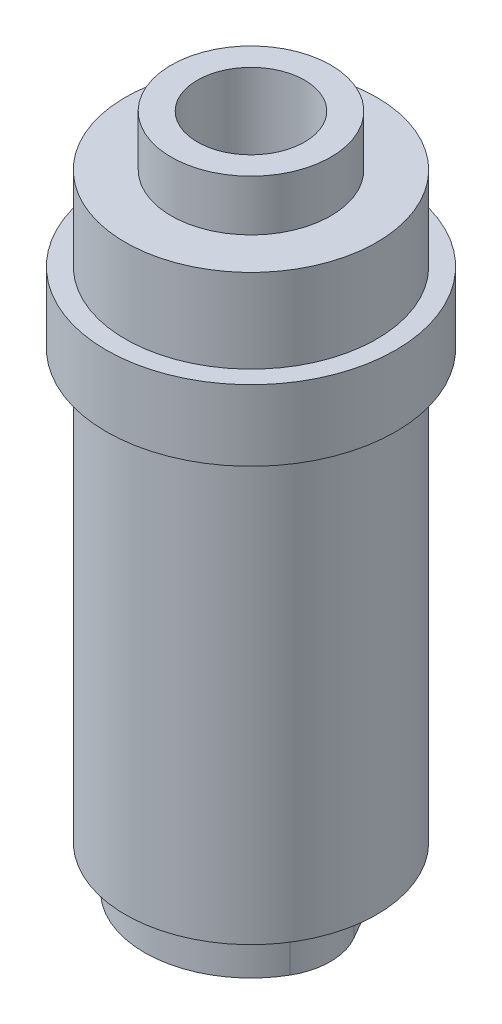
ISO-10303-21;
HEADER;
FILE_DESCRIPTION(('STEP AP214'),'2;1');
FILE_NAME('part.step','',(''),(''),'','','');
FILE_SCHEMA(('AUTOMOTIVE_DESIGN { 1 0 10303 214 1 1 1 1 }'));
ENDSEC;
DATA;
#1=APPLICATION_CONTEXT('core data for automotive mechanical design processes');
#2=APPLICATION_PROTOCOL_DEFINITION('international standard','automotive_design',2000,#1);
#3=PRODUCT_CONTEXT('',#1,'mechanical');
#4=PRODUCT('Part','Part','',(#3));
#5=PRODUCT_RELATED_PRODUCT_CATEGORY('part','',(#4));
#6=PRODUCT_DEFINITION_FORMATION('','',#4);
#7=PRODUCT_DEFINITION_CONTEXT('part definition',#1,'design');
#8=PRODUCT_DEFINITION('design','',#6,#7);
#9=PRODUCT_DEFINITION_SHAPE('','',#8);
#10=(LENGTH_UNIT() NAMED_UNIT(*) SI_UNIT(.MILLI.,.METRE.));
#11=(NAMED_UNIT(*) PLANE_ANGLE_UNIT() SI_UNIT($,.RADIAN.));
#12=(NAMED_UNIT(*) SI_UNIT($,.STERADIAN.) SOLID_ANGLE_UNIT());
#13=UNCERTAINTY_MEASURE_WITH_UNIT(LENGTH_MEASURE(1.E-05),#10,'distance_accuracy_value','');
#14=(GEOMETRIC_REPRESENTATION_CONTEXT(3) GLOBAL_UNCERTAINTY_ASSIGNED_CONTEXT((#13)) GLOBAL_UNIT_ASSIGNED_CONTEXT((#10,
#11,#12)) REPRESENTATION_CONTEXT('',''));
#15=CARTESIAN_POINT('',(0.,0.,0.));
#16=DIRECTION('',(0.,0.,1.));
#17=DIRECTION('',(1.,0.,0.));
#18=AXIS2_PLACEMENT_3D('',#15,#16,#17);
#19=CARTESIAN_POINT('',(0.,19.05,0.));
#20=DIRECTION('',(0.,-1.,0.));
#21=DIRECTION('',(0.,0.,-1.));
#22=AXIS2_PLACEMENT_3D('',#19,#20,#21);
#23=CYLINDRICAL_SURFACE('',#22,4.7625);
#24=CARTESIAN_POINT('',(0.,37.285900282,0.));
#25=DIRECTION('',(0.,-1.,0.));
#26=DIRECTION('',(0.,0.,-1.));
#27=AXIS2_PLACEMENT_3D('',#24,#25,#26);
#28=CIRCLE('',#27,4.7625);
#29=CARTESIAN_POINT('',(0.,37.285900282,-4.7625));
#30=VERTEX_POINT('',#29);
#31=EDGE_CURVE('E97',#30,#30,#28,.T.);
#32=ORIENTED_EDGE('',*,*,#31,.F.);
#33=EDGE_LOOP('',(#32));
#34=FACE_BOUND('',#33,.T.);
#35=CARTESIAN_POINT('',(0.,40.321700408,0.));
#36=DIRECTION('',(0.,-1.,0.));
#37=DIRECTION('',(0.,0.,-1.));
#38=AXIS2_PLACEMENT_3D('',#35,#36,#37);
#39=CIRCLE('',#38,4.7625);
#40=CARTESIAN_POINT('',(0.,40.321700408,-4.7625));
#41=VERTEX_POINT('',#40);
#42=EDGE_CURVE('E11',#41,#41,#39,.T.);
#43=ORIENTED_EDGE('',*,*,#42,.T.);
#44=EDGE_LOOP('',(#43));
#45=FACE_BOUND('',#44,.T.);
#46=ADVANCED_FACE('F16',(#34,#45),#23,.T.);
#47=CARTESIAN_POINT('',(-4.7625,40.321700408,0.));
#48=DIRECTION('',(0.,-1.,0.));
#49=DIRECTION('',(0.,0.,-1.));
#50=AXIS2_PLACEMENT_3D('',#47,#48,#49);
#51=PLANE('',#50);
#52=ORIENTED_EDGE('',*,*,#42,.F.);
#53=EDGE_LOOP('',(#52));
#54=FACE_BOUND('',#53,.T.);
#55=CARTESIAN_POINT('',(0.,40.321700408,0.));
#56=DIRECTION('',(0.,-1.,0.));
#57=DIRECTION('',(0.,0.,-1.));
#58=AXIS2_PLACEMENT_3D('',#55,#56,#57);
#59=CIRCLE('',#58,3.2004);
#60=CARTESIAN_POINT('',(0.,40.321700408,-3.2004));
#61=VERTEX_POINT('',#60);
#62=EDGE_CURVE('E23',#61,#61,#59,.T.);
#63=ORIENTED_EDGE('',*,*,#62,.T.);
#64=EDGE_LOOP('',(#63));
#65=FACE_BOUND('',#64,.T.);
#66=ADVANCED_FACE('F150',(#54,#65),#51,.F.);
#67=CARTESIAN_POINT('',(0.,19.05,0.));
#68=DIRECTION('',(0.,-1.,0.));
#69=DIRECTION('',(0.,0.,-1.));
#70=AXIS2_PLACEMENT_3D('',#67,#68,#69);
#71=CYLINDRICAL_SURFACE('',#70,3.2004);
#72=ORIENTED_EDGE('',*,*,#62,.F.);
#73=EDGE_LOOP('',(#72));
#74=FACE_BOUND('',#73,.T.);
#75=CARTESIAN_POINT('',(0.,27.621700408,0.));
#76=DIRECTION('',(0.,-1.,0.));
#77=DIRECTION('',(0.,0.,-1.));
#78=AXIS2_PLACEMENT_3D('',#75,#76,#77);
#79=CIRCLE('',#78,3.2004);
#80=CARTESIAN_POINT('',(0.,27.621700408,-3.2004));
#81=VERTEX_POINT('',#80);
#82=EDGE_CURVE('E145',#81,#81,#79,.T.);
#83=ORIENTED_EDGE('',*,*,#82,.T.);
#84=EDGE_LOOP('',(#83));
#85=FACE_BOUND('',#84,.T.);
#86=ADVANCED_FACE('F152',(#74,#85),#71,.F.);
#87=CARTESIAN_POINT('',(-3.2004,27.621700408,0.));
#88=DIRECTION('',(0.,-1.,0.));
#89=DIRECTION('',(0.,0.,-1.));
#90=AXIS2_PLACEMENT_3D('',#87,#88,#89);
#91=PLANE('',#90);
#92=ORIENTED_EDGE('',*,*,#82,.F.);
#93=EDGE_LOOP('',(#92));
#94=FACE_BOUND('',#93,.T.);
#95=ADVANCED_FACE('F155',(#94),#91,.F.);
#96=CARTESIAN_POINT('',(-7.499999986,2.54,0.));
#97=DIRECTION('',(0.,1.,0.));
#98=DIRECTION('',(0.,0.,1.));
#99=AXIS2_PLACEMENT_3D('',#96,#97,#98);
#100=PLANE('',#99);
#101=CARTESIAN_POINT('',(0.,2.54,0.));
#102=DIRECTION('',(0.,-1.,0.));
#103=DIRECTION('',(0.,0.,-1.));
#104=AXIS2_PLACEMENT_3D('',#101,#102,#103);
#105=CIRCLE('',#104,7.499999986);
#106=CARTESIAN_POINT('',(0.,2.54,-7.499999986));
#107=VERTEX_POINT('',#106);
#108=EDGE_CURVE('E130',#107,#107,#105,.T.);
#109=ORIENTED_EDGE('',*,*,#108,.T.);
#110=EDGE_LOOP('',(#109));
#111=FACE_BOUND('',#110,.T.);
#112=DIRECTION('',(0.5,0.,-0.866025403784439));
#113=VECTOR('',#112,1.);
#114=CARTESIAN_POINT('',(-5.49926131403119,2.54,-0.635));
#115=LINE('',#114,#113);
#116=CARTESIAN_POINT('',(-5.49926131403119,2.54,-0.635));
#117=VERTEX_POINT('',#116);
#118=CARTESIAN_POINT('',(-3.29955678841871,2.54,-4.445));
#119=VERTEX_POINT('',#118);
#120=EDGE_CURVE('E87',#117,#119,#115,.T.);
#121=ORIENTED_EDGE('',*,*,#120,.F.);
#122=CARTESIAN_POINT('',(-2.19970452561247,2.54,1.27));
#123=DIRECTION('',(0.,1.,0.));
#124=DIRECTION('',(0.,0.,1.));
#125=AXIS2_PLACEMENT_3D('',#122,#123,#124);
#126=CIRCLE('',#125,3.81);
#127=CARTESIAN_POINT('',(-5.49926131403119,2.54,3.175));
#128=VERTEX_POINT('',#127);
#129=EDGE_CURVE('E94',#128,#117,#126,.F.);
#130=ORIENTED_EDGE('',*,*,#129,.F.);
#131=CARTESIAN_POINT('',(0.,2.54,0.));
#132=DIRECTION('',(0.,1.,0.));
#133=DIRECTION('',(0.,0.,1.));
#134=AXIS2_PLACEMENT_3D('',#131,#132,#133);
#135=CIRCLE('',#134,6.35);
#136=CARTESIAN_POINT('',(5.49926131403119,2.54,3.175));
#137=VERTEX_POINT('',#136);
#138=EDGE_CURVE('E98',#137,#128,#135,.F.);
#139=ORIENTED_EDGE('',*,*,#138,.F.);
#140=CARTESIAN_POINT('',(2.19970452561247,2.54,1.27));
#141=DIRECTION('',(0.,1.,0.));
#142=DIRECTION('',(0.,0.,1.));
#143=AXIS2_PLACEMENT_3D('',#140,#141,#142);
#144=CIRCLE('',#143,3.81);
#145=CARTESIAN_POINT('',(5.49926131403119,2.54,-0.635));
#146=VERTEX_POINT('',#145);
#147=EDGE_CURVE('E82',#146,#137,#144,.F.);
#148=ORIENTED_EDGE('',*,*,#147,.F.);
#149=DIRECTION('',(0.5,0.,0.866025403784439));
#150=VECTOR('',#149,1.);
#151=CARTESIAN_POINT('',(3.29955678841871,2.54,-4.445));
#152=LINE('',#151,#150);
#153=CARTESIAN_POINT('',(3.29955678841871,2.54,-4.445));
#154=VERTEX_POINT('',#153);
#155=EDGE_CURVE('E70',#154,#146,#152,.T.);
#156=ORIENTED_EDGE('',*,*,#155,.F.);
#157=CARTESIAN_POINT('',(0.,2.54,-2.54));
#158=DIRECTION('',(0.,1.,0.));
#159=DIRECTION('',(0.,0.,1.));
#160=AXIS2_PLACEMENT_3D('',#157,#158,#159);
#161=CIRCLE('',#160,3.81);
#162=EDGE_CURVE('E80',#119,#154,#161,.F.);
#163=ORIENTED_EDGE('',*,*,#162,.F.);
#164=EDGE_LOOP('',(#121,#130,#139,#148,#156,#163));
#165=FACE_BOUND('',#164,.T.);
#166=ADVANCED_FACE('F79',(#111,#165),#100,.F.);
#167=CARTESIAN_POINT('',(0.,19.05,0.));
#168=DIRECTION('',(0.,-1.,0.));
#169=DIRECTION('',(0.,0.,-1.));
#170=AXIS2_PLACEMENT_3D('',#167,#168,#169);
#171=CYLINDRICAL_SURFACE('',#170,7.499999986);
#172=ORIENTED_EDGE('',*,*,#108,.F.);
#173=EDGE_LOOP('',(#172));
#174=FACE_BOUND('',#173,.T.);
#175=CARTESIAN_POINT('',(0.,28.067,0.));
#176=DIRECTION('',(0.,-1.,0.));
#177=DIRECTION('',(0.,0.,-1.));
#178=AXIS2_PLACEMENT_3D('',#175,#176,#177);
#179=CIRCLE('',#178,7.499999986);
#180=CARTESIAN_POINT('',(0.,28.067,-7.499999986));
#181=VERTEX_POINT('',#180);
#182=EDGE_CURVE('E127',#181,#181,#179,.T.);
#183=ORIENTED_EDGE('',*,*,#182,.T.);
#184=EDGE_LOOP('',(#183));
#185=FACE_BOUND('',#184,.T.);
#186=ADVANCED_FACE('F166',(#174,#185),#171,.T.);
#187=CARTESIAN_POINT('',(-8.636,28.067,0.));
#188=DIRECTION('',(0.,1.,0.));
#189=DIRECTION('',(0.,0.,1.));
#190=AXIS2_PLACEMENT_3D('',#187,#188,#189);
#191=PLANE('',#190);
#192=ORIENTED_EDGE('',*,*,#182,.F.);
#193=EDGE_LOOP('',(#192));
#194=FACE_BOUND('',#193,.T.);
#195=CARTESIAN_POINT('',(0.,28.067,0.));
#196=DIRECTION('',(0.,-1.,0.));
#197=DIRECTION('',(0.,0.,-1.));
#198=AXIS2_PLACEMENT_3D('',#195,#196,#197);
#199=CIRCLE('',#198,8.636);
#200=CARTESIAN_POINT('',(0.,28.067,-8.636));
#201=VERTEX_POINT('',#200);
#202=EDGE_CURVE('E124',#201,#201,#199,.T.);
#203=ORIENTED_EDGE('',*,*,#202,.T.);
#204=EDGE_LOOP('',(#203));
#205=FACE_BOUND('',#204,.T.);
#206=ADVANCED_FACE('F205',(#194,#205),#191,.F.);
#207=CARTESIAN_POINT('',(0.,19.05,0.));
#208=DIRECTION('',(0.,-1.,0.));
#209=DIRECTION('',(0.,0.,-1.));
#210=AXIS2_PLACEMENT_3D('',#207,#208,#209);
#211=CYLINDRICAL_SURFACE('',#210,8.636);
#212=ORIENTED_EDGE('',*,*,#202,.F.);
#213=EDGE_LOOP('',(#212));
#214=FACE_BOUND('',#213,.T.);
#215=CARTESIAN_POINT('',(0.,32.285900376,0.));
#216=DIRECTION('',(0.,-1.,0.));
#217=DIRECTION('',(0.,0.,-1.));
#218=AXIS2_PLACEMENT_3D('',#215,#216,#217);
#219=CIRCLE('',#218,8.636);
#220=CARTESIAN_POINT('',(0.,32.285900376,-8.636));
#221=VERTEX_POINT('',#220);
#222=EDGE_CURVE('E121',#221,#221,#219,.T.);
#223=ORIENTED_EDGE('',*,*,#222,.T.);
#224=EDGE_LOOP('',(#223));
#225=FACE_BOUND('',#224,.T.);
#226=ADVANCED_FACE('F201',(#214,#225),#211,.T.);
#227=CARTESIAN_POINT('',(-8.636,32.285900376,0.));
#228=DIRECTION('',(0.,-1.,0.));
#229=DIRECTION('',(0.,0.,-1.));
#230=AXIS2_PLACEMENT_3D('',#227,#228,#229);
#231=PLANE('',#230);
#232=ORIENTED_EDGE('',*,*,#222,.F.);
#233=EDGE_LOOP('',(#232));
#234=FACE_BOUND('',#233,.T.);
#235=CARTESIAN_POINT('',(0.,32.285900376,0.));
#236=DIRECTION('',(0.,-1.,0.));
#237=DIRECTION('',(0.,0.,-1.));
#238=AXIS2_PLACEMENT_3D('',#235,#236,#237);
#239=CIRCLE('',#238,7.499999986);
#240=CARTESIAN_POINT('',(0.,32.285900376,-7.499999986));
#241=VERTEX_POINT('',#240);
#242=EDGE_CURVE('E118',#241,#241,#239,.T.);
#243=ORIENTED_EDGE('',*,*,#242,.T.);
#244=EDGE_LOOP('',(#243));
#245=FACE_BOUND('',#244,.T.);
#246=ADVANCED_FACE('F193',(#234,#245),#231,.F.);
#247=CARTESIAN_POINT('',(0.,19.05,0.));
#248=DIRECTION('',(0.,-1.,0.));
#249=DIRECTION('',(0.,0.,-1.));
#250=AXIS2_PLACEMENT_3D('',#247,#248,#249);
#251=CYLINDRICAL_SURFACE('',#250,7.499999986);
#252=ORIENTED_EDGE('',*,*,#242,.F.);
#253=EDGE_LOOP('',(#252));
#254=FACE_BOUND('',#253,.T.);
#255=CARTESIAN_POINT('',(0.,37.285900282,0.));
#256=DIRECTION('',(0.,-1.,0.));
#257=DIRECTION('',(0.,0.,-1.));
#258=AXIS2_PLACEMENT_3D('',#255,#256,#257);
#259=CIRCLE('',#258,7.499999986);
#260=CARTESIAN_POINT('',(0.,37.285900282,-7.499999986));
#261=VERTEX_POINT('',#260);
#262=EDGE_CURVE('E115',#261,#261,#259,.T.);
#263=ORIENTED_EDGE('',*,*,#262,.T.);
#264=EDGE_LOOP('',(#263));
#265=FACE_BOUND('',#264,.T.);
#266=ADVANCED_FACE('F183',(#254,#265),#251,.T.);
#267=CARTESIAN_POINT('',(-4.7625,37.285900282,0.));
#268=DIRECTION('',(0.,-1.,0.));
#269=DIRECTION('',(0.,0.,-1.));
#270=AXIS2_PLACEMENT_3D('',#267,#268,#269);
#271=PLANE('',#270);
#272=ORIENTED_EDGE('',*,*,#262,.F.);
#273=EDGE_LOOP('',(#272));
#274=FACE_BOUND('',#273,.T.);
#275=ORIENTED_EDGE('',*,*,#31,.T.);
#276=EDGE_LOOP('',(#275));
#277=FACE_BOUND('',#276,.T.);
#278=ADVANCED_FACE('F181',(#274,#277),#271,.F.);
#279=CARTESIAN_POINT('',(0.,23.6095192980614,-2.54));
#280=DIRECTION('',(0.,-1.,0.));
#281=DIRECTION('',(0.,0.,-1.));
#282=AXIS2_PLACEMENT_3D('',#279,#280,#281);
#283=CYLINDRICAL_SURFACE('',#282,3.81);
#284=ORIENTED_EDGE('',*,*,#162,.T.);
#285=DIRECTION('',(0.,-1.,0.));
#286=VECTOR('',#285,1.);
#287=CARTESIAN_POINT('',(3.29955678841871,23.6095192980614,-4.445));
#288=LINE('',#287,#286);
#289=CARTESIAN_POINT('',(3.29955678841871,0.,-4.445));
#290=VERTEX_POINT('',#289);
#291=EDGE_CURVE('E67',#154,#290,#288,.T.);
#292=ORIENTED_EDGE('',*,*,#291,.T.);
#293=CARTESIAN_POINT('',(0.,0.,-2.54));
#294=DIRECTION('',(0.,-1.,0.));
#295=DIRECTION('',(0.,0.,-1.));
#296=AXIS2_PLACEMENT_3D('',#293,#294,#295);
#297=CIRCLE('',#296,3.81);
#298=CARTESIAN_POINT('',(-3.29955678841871,0.,-4.445));
#299=VERTEX_POINT('',#298);
#300=EDGE_CURVE('E91',#299,#290,#297,.T.);
#301=ORIENTED_EDGE('',*,*,#300,.F.);
#302=DIRECTION('',(0.,-1.,0.));
#303=VECTOR('',#302,1.);
#304=CARTESIAN_POINT('',(-3.29955678841871,23.6095192980614,-4.445));
#305=LINE('',#304,#303);
#306=EDGE_CURVE('E85',#119,#299,#305,.T.);
#307=ORIENTED_EDGE('',*,*,#306,.F.);
#308=EDGE_LOOP('',(#284,#292,#301,#307));
#309=FACE_BOUND('',#308,.T.);
#310=ADVANCED_FACE('F84',(#309),#283,.T.);
#311=CARTESIAN_POINT('',(-5.49926131403119,23.6095192980614,-0.635));
#312=DIRECTION('',(-0.866025403784439,0.,-0.5));
#313=DIRECTION('',(-0.5,0.,0.866025403784439));
#314=AXIS2_PLACEMENT_3D('',#311,#312,#313);
#315=PLANE('',#314);
#316=ORIENTED_EDGE('',*,*,#120,.T.);
#317=ORIENTED_EDGE('',*,*,#306,.T.);
#318=DIRECTION('',(0.5,0.,-0.866025403784439));
#319=VECTOR('',#318,1.);
#320=CARTESIAN_POINT('',(-5.49926131403119,0.,-0.635));
#321=LINE('',#320,#319);
#322=CARTESIAN_POINT('',(-5.49926131403119,0.,-0.635));
#323=VERTEX_POINT('',#322);
#324=EDGE_CURVE('E105',#323,#299,#321,.T.);
#325=ORIENTED_EDGE('',*,*,#324,.F.);
#326=DIRECTION('',(0.,-1.,0.));
#327=VECTOR('',#326,1.);
#328=CARTESIAN_POINT('',(-5.49926131403119,23.6095192980614,-0.635));
#329=LINE('',#328,#327);
#330=EDGE_CURVE('E103',#117,#323,#329,.T.);
#331=ORIENTED_EDGE('',*,*,#330,.F.);
#332=EDGE_LOOP('',(#316,#317,#325,#331));
#333=FACE_BOUND('',#332,.T.);
#334=ADVANCED_FACE('F191',(#333),#315,.T.);
#335=CARTESIAN_POINT('',(-2.19970452561247,23.6095192980614,1.27));
#336=DIRECTION('',(0.,-1.,0.));
#337=DIRECTION('',(0.,0.,-1.));
#338=AXIS2_PLACEMENT_3D('',#335,#336,#337);
#339=CYLINDRICAL_SURFACE('',#338,3.81);
#340=ORIENTED_EDGE('',*,*,#129,.T.);
#341=ORIENTED_EDGE('',*,*,#330,.T.);
#342=CARTESIAN_POINT('',(-2.19970452561247,0.,1.27));
#343=DIRECTION('',(0.,-1.,0.));
#344=DIRECTION('',(0.,0.,-1.));
#345=AXIS2_PLACEMENT_3D('',#342,#343,#344);
#346=CIRCLE('',#345,3.81);
#347=CARTESIAN_POINT('',(-5.49926131403119,0.,3.175));
#348=VERTEX_POINT('',#347);
#349=EDGE_CURVE('E108',#348,#323,#346,.T.);
#350=ORIENTED_EDGE('',*,*,#349,.F.);
#351=DIRECTION('',(0.,-1.,0.));
#352=VECTOR('',#351,1.);
#353=CARTESIAN_POINT('',(-5.49926131403119,23.6095192980614,3.175));
#354=LINE('',#353,#352);
#355=EDGE_CURVE('E106',#128,#348,#354,.T.);
#356=ORIENTED_EDGE('',*,*,#355,.F.);
#357=EDGE_LOOP('',(#340,#341,#350,#356));
#358=FACE_BOUND('',#357,.T.);
#359=ADVANCED_FACE('F262',(#358),#339,.T.);
#360=CARTESIAN_POINT('',(0.,23.6095192980614,0.));
#361=DIRECTION('',(0.,-1.,0.));
#362=DIRECTION('',(0.,0.,-1.));
#363=AXIS2_PLACEMENT_3D('',#360,#361,#362);
#364=CYLINDRICAL_SURFACE('',#363,6.35);
#365=ORIENTED_EDGE('',*,*,#138,.T.);
#366=ORIENTED_EDGE('',*,*,#355,.T.);
#367=CARTESIAN_POINT('',(0.,0.,0.));
#368=DIRECTION('',(0.,-1.,0.));
#369=DIRECTION('',(0.,0.,-1.));
#370=AXIS2_PLACEMENT_3D('',#367,#368,#369);
#371=CIRCLE('',#370,6.35);
#372=CARTESIAN_POINT('',(5.49926131403119,0.,3.175));
#373=VERTEX_POINT('',#372);
#374=EDGE_CURVE('E111',#373,#348,#371,.T.);
#375=ORIENTED_EDGE('',*,*,#374,.F.);
#376=DIRECTION('',(0.,-1.,0.));
#377=VECTOR('',#376,1.);
#378=CARTESIAN_POINT('',(5.49926131403119,23.6095192980614,3.175));
#379=LINE('',#378,#377);
#380=EDGE_CURVE('E109',#137,#373,#379,.T.);
#381=ORIENTED_EDGE('',*,*,#380,.F.);
#382=EDGE_LOOP('',(#365,#366,#375,#381));
#383=FACE_BOUND('',#382,.T.);
#384=ADVANCED_FACE('F259',(#383),#364,.T.);
#385=CARTESIAN_POINT('',(2.19970452561247,23.6095192980614,1.27));
#386=DIRECTION('',(0.,-1.,0.));
#387=DIRECTION('',(0.,0.,-1.));
#388=AXIS2_PLACEMENT_3D('',#385,#386,#387);
#389=CYLINDRICAL_SURFACE('',#388,3.81);
#390=ORIENTED_EDGE('',*,*,#147,.T.);
#391=ORIENTED_EDGE('',*,*,#380,.T.);
#392=CARTESIAN_POINT('',(2.19970452561247,0.,1.27));
#393=DIRECTION('',(0.,-1.,0.));
#394=DIRECTION('',(0.,0.,-1.));
#395=AXIS2_PLACEMENT_3D('',#392,#393,#394);
#396=CIRCLE('',#395,3.81);
#397=CARTESIAN_POINT('',(5.49926131403119,0.,-0.635));
#398=VERTEX_POINT('',#397);
#399=EDGE_CURVE('E30',#398,#373,#396,.T.);
#400=ORIENTED_EDGE('',*,*,#399,.F.);
#401=DIRECTION('',(0.,-1.,0.));
#402=VECTOR('',#401,1.);
#403=CARTESIAN_POINT('',(5.49926131403119,23.6095192980614,-0.635));
#404=LINE('',#403,#402);
#405=EDGE_CURVE('E34',#146,#398,#404,.T.);
#406=ORIENTED_EDGE('',*,*,#405,.F.);
#407=EDGE_LOOP('',(#390,#391,#400,#406));
#408=FACE_BOUND('',#407,.T.);
#409=ADVANCED_FACE('F235',(#408),#389,.T.);
#410=CARTESIAN_POINT('',(3.29955678841871,23.6095192980614,-4.445));
#411=DIRECTION('',(0.866025403784439,0.,-0.5));
#412=DIRECTION('',(-0.5,0.,-0.866025403784439));
#413=AXIS2_PLACEMENT_3D('',#410,#411,#412);
#414=PLANE('',#413);
#415=ORIENTED_EDGE('',*,*,#155,.T.);
#416=ORIENTED_EDGE('',*,*,#405,.T.);
#417=DIRECTION('',(0.5,0.,0.866025403784439));
#418=VECTOR('',#417,1.);
#419=CARTESIAN_POINT('',(3.29955678841871,0.,-4.445));
#420=LINE('',#419,#418);
#421=EDGE_CURVE('E72',#290,#398,#420,.T.);
#422=ORIENTED_EDGE('',*,*,#421,.F.);
#423=ORIENTED_EDGE('',*,*,#291,.F.);
#424=EDGE_LOOP('',(#415,#416,#422,#423));
#425=FACE_BOUND('',#424,.T.);
#426=ADVANCED_FACE('F69',(#425),#414,.T.);
#427=CARTESIAN_POINT('',(-2.5527,19.05,0.));
#428=DIRECTION('',(0.,1.,0.));
#429=DIRECTION('',(0.,0.,1.));
#430=AXIS2_PLACEMENT_3D('',#427,#428,#429);
#431=PLANE('',#430);
#432=CARTESIAN_POINT('',(0.,19.05,0.));
#433=DIRECTION('',(0.,-1.,0.));
#434=DIRECTION('',(0.,0.,-1.));
#435=AXIS2_PLACEMENT_3D('',#432,#433,#434);
#436=CIRCLE('',#435,2.5527);
#437=CARTESIAN_POINT('',(0.,19.05,-2.5527));
#438=VERTEX_POINT('',#437);
#439=EDGE_CURVE('E142',#438,#438,#436,.T.);
#440=ORIENTED_EDGE('',*,*,#439,.T.);
#441=EDGE_LOOP('',(#440));
#442=FACE_BOUND('',#441,.T.);
#443=ADVANCED_FACE('F227',(#442),#431,.F.);
#444=CARTESIAN_POINT('',(0.,19.05,0.));
#445=DIRECTION('',(0.,-1.,0.));
#446=DIRECTION('',(0.,0.,-1.));
#447=AXIS2_PLACEMENT_3D('',#444,#445,#446);
#448=CYLINDRICAL_SURFACE('',#447,2.5527);
#449=ORIENTED_EDGE('',*,*,#439,.F.);
#450=EDGE_LOOP('',(#449));
#451=FACE_BOUND('',#450,.T.);
#452=CARTESIAN_POINT('',(0.,6.35,0.));
#453=DIRECTION('',(0.,-1.,0.));
#454=DIRECTION('',(0.,0.,-1.));
#455=AXIS2_PLACEMENT_3D('',#452,#453,#454);
#456=CIRCLE('',#455,2.5527);
#457=CARTESIAN_POINT('',(0.,6.35,-2.5527));
#458=VERTEX_POINT('',#457);
#459=EDGE_CURVE('E139',#458,#458,#456,.T.);
#460=ORIENTED_EDGE('',*,*,#459,.T.);
#461=EDGE_LOOP('',(#460));
#462=FACE_BOUND('',#461,.T.);
#463=ADVANCED_FACE('F224',(#451,#462),#448,.F.);
#464=CARTESIAN_POINT('',(-2.5527,6.35,0.));
#465=DIRECTION('',(0.,1.,0.));
#466=DIRECTION('',(0.,0.,1.));
#467=AXIS2_PLACEMENT_3D('',#464,#465,#466);
#468=PLANE('',#467);
#469=ORIENTED_EDGE('',*,*,#459,.F.);
#470=EDGE_LOOP('',(#469));
#471=FACE_BOUND('',#470,.T.);
#472=CARTESIAN_POINT('',(0.,6.35,0.));
#473=DIRECTION('',(0.,-1.,0.));
#474=DIRECTION('',(0.,0.,-1.));
#475=AXIS2_PLACEMENT_3D('',#472,#473,#474);
#476=CIRCLE('',#475,3.2639);
#477=CARTESIAN_POINT('',(0.,6.35,-3.2639));
#478=VERTEX_POINT('',#477);
#479=EDGE_CURVE('E136',#478,#478,#476,.T.);
#480=ORIENTED_EDGE('',*,*,#479,.T.);
#481=EDGE_LOOP('',(#480));
#482=FACE_BOUND('',#481,.T.);
#483=ADVANCED_FACE('F220',(#471,#482),#468,.F.);
#484=CARTESIAN_POINT('',(0.,19.05,0.));
#485=DIRECTION('',(0.,-1.,0.));
#486=DIRECTION('',(0.,0.,-1.));
#487=AXIS2_PLACEMENT_3D('',#484,#485,#486);
#488=CYLINDRICAL_SURFACE('',#487,3.2639);
#489=ORIENTED_EDGE('',*,*,#479,.F.);
#490=EDGE_LOOP('',(#489));
#491=FACE_BOUND('',#490,.T.);
#492=CARTESIAN_POINT('',(0.,0.,0.));
#493=DIRECTION('',(0.,-1.,0.));
#494=DIRECTION('',(0.,0.,-1.));
#495=AXIS2_PLACEMENT_3D('',#492,#493,#494);
#496=CIRCLE('',#495,3.2639);
#497=CARTESIAN_POINT('',(0.,0.,-3.2639));
#498=VERTEX_POINT('',#497);
#499=EDGE_CURVE('E133',#498,#498,#496,.T.);
#500=ORIENTED_EDGE('',*,*,#499,.T.);
#501=EDGE_LOOP('',(#500));
#502=FACE_BOUND('',#501,.T.);
#503=ADVANCED_FACE('F216',(#491,#502),#488,.F.);
#504=CARTESIAN_POINT('',(-7.449199986,0.,0.));
#505=DIRECTION('',(0.,1.,0.));
#506=DIRECTION('',(0.,0.,1.));
#507=AXIS2_PLACEMENT_3D('',#504,#505,#506);
#508=PLANE('',#507);
#509=ORIENTED_EDGE('',*,*,#499,.F.);
#510=EDGE_LOOP('',(#509));
#511=FACE_BOUND('',#510,.T.);
#512=ORIENTED_EDGE('',*,*,#300,.T.);
#513=ORIENTED_EDGE('',*,*,#421,.T.);
#514=ORIENTED_EDGE('',*,*,#399,.T.);
#515=ORIENTED_EDGE('',*,*,#374,.T.);
#516=ORIENTED_EDGE('',*,*,#349,.T.);
#517=ORIENTED_EDGE('',*,*,#324,.T.);
#518=EDGE_LOOP('',(#512,#513,#514,#515,#516,#517));
#519=FACE_BOUND('',#518,.T.);
#520=ADVANCED_FACE('F213',(#511,#519),#508,.F.);
#521=CLOSED_SHELL('',(#46,#66,#86,#95,#166,#186,#206,#226,#246,#266,#278,#310,#334,#359,#384,
#409,#426,#443,#463,#483,#503,#520));
#522=MANIFOLD_SOLID_BREP('B1',#521);
#523=ADVANCED_BREP_SHAPE_REPRESENTATION('',(#18,#522),#14);
#524=SHAPE_DEFINITION_REPRESENTATION(#9,#523);
ENDSEC;
END-ISO-10303-21;
